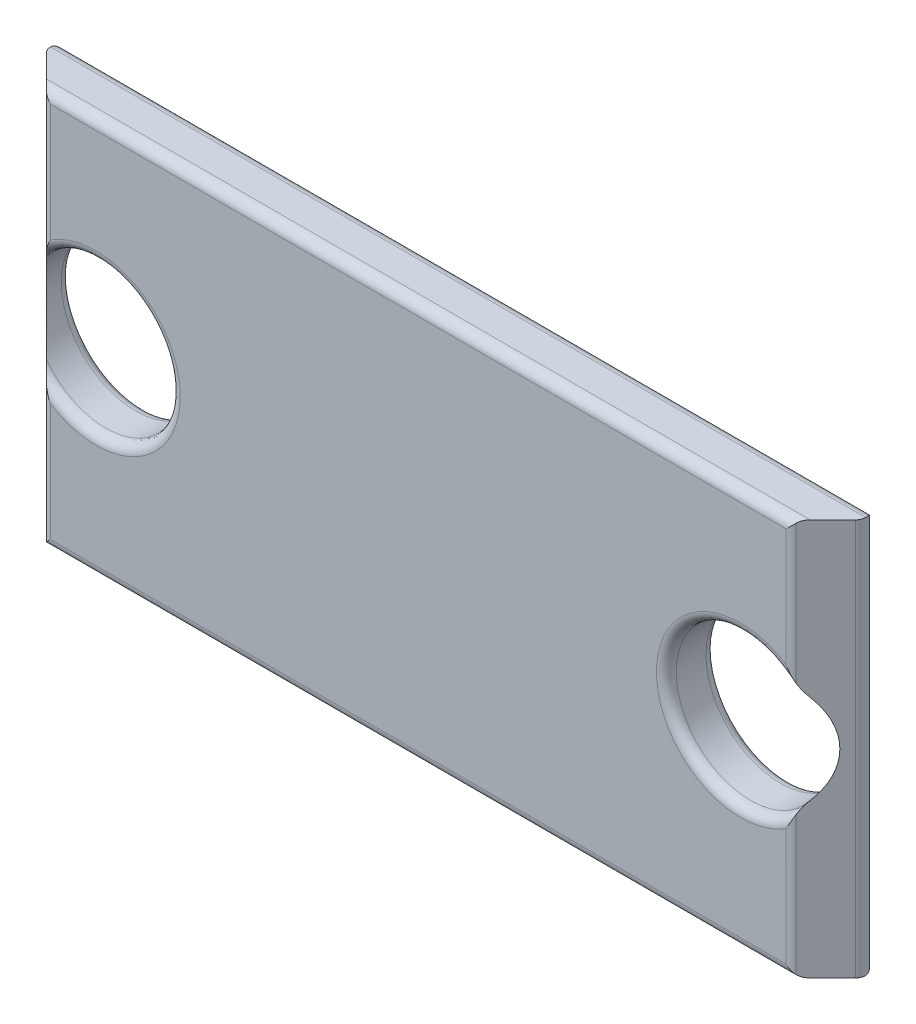
ISO-10303-21;
HEADER;
FILE_DESCRIPTION(('STEP AP214'),'2;1');
FILE_NAME('part.step','',(''),(''),'','','');
FILE_SCHEMA(('AUTOMOTIVE_DESIGN { 1 0 10303 214 1 1 1 1 }'));
ENDSEC;
DATA;
#1=APPLICATION_CONTEXT('core data for automotive mechanical design processes');
#2=APPLICATION_PROTOCOL_DEFINITION('international standard','automotive_design',2000,#1);
#3=PRODUCT_CONTEXT('',#1,'mechanical');
#4=PRODUCT('Part','Part','',(#3));
#5=PRODUCT_RELATED_PRODUCT_CATEGORY('part','',(#4));
#6=PRODUCT_DEFINITION_FORMATION('','',#4);
#7=PRODUCT_DEFINITION_CONTEXT('part definition',#1,'design');
#8=PRODUCT_DEFINITION('design','',#6,#7);
#9=PRODUCT_DEFINITION_SHAPE('','',#8);
#10=(LENGTH_UNIT() NAMED_UNIT(*) SI_UNIT(.MILLI.,.METRE.));
#11=(NAMED_UNIT(*) PLANE_ANGLE_UNIT() SI_UNIT($,.RADIAN.));
#12=(NAMED_UNIT(*) SI_UNIT($,.STERADIAN.) SOLID_ANGLE_UNIT());
#13=UNCERTAINTY_MEASURE_WITH_UNIT(LENGTH_MEASURE(1.E-05),#10,'distance_accuracy_value','');
#14=(GEOMETRIC_REPRESENTATION_CONTEXT(3) GLOBAL_UNCERTAINTY_ASSIGNED_CONTEXT((#13)) GLOBAL_UNIT_ASSIGNED_CONTEXT((#10,
#11,#12)) REPRESENTATION_CONTEXT('',''));
#15=CARTESIAN_POINT('',(0.,0.,0.));
#16=DIRECTION('',(0.,0.,1.));
#17=DIRECTION('',(1.,0.,0.));
#18=AXIS2_PLACEMENT_3D('',#15,#16,#17);
#19=CARTESIAN_POINT('',(0.,0.,1.));
#20=DIRECTION('',(0.,0.,-1.));
#21=DIRECTION('',(-1.,0.,0.));
#22=AXIS2_PLACEMENT_3D('',#19,#20,#21);
#23=PLANE('',#22);
#24=CARTESIAN_POINT('',(2.,4.,1.));
#25=DIRECTION('',(0.,0.,-1.));
#26=DIRECTION('',(-1.,0.,0.));
#27=AXIS2_PLACEMENT_3D('',#24,#25,#26);
#28=CIRCLE('',#27,1.7);
#29=CARTESIAN_POINT('',(1.08284271247464,5.43137084989849,1.));
#30=VERTEX_POINT('',#29);
#31=CARTESIAN_POINT('',(1.08284271247464,2.56862915010151,1.));
#32=VERTEX_POINT('',#31);
#33=EDGE_CURVE('E42',#30,#32,#28,.T.);
#34=ORIENTED_EDGE('',*,*,#33,.T.);
#35=DIRECTION('',(0.,1.,0.));
#36=VECTOR('',#35,1.);
#37=CARTESIAN_POINT('',(1.08284271247464,0.,1.));
#38=LINE('',#37,#36);
#39=CARTESIAN_POINT('',(1.08284271247464,0.2,1.));
#40=VERTEX_POINT('',#39);
#41=EDGE_CURVE('E11',#32,#40,#38,.F.);
#42=ORIENTED_EDGE('',*,*,#41,.T.);
#43=DIRECTION('',(1.,0.,0.));
#44=VECTOR('',#43,1.);
#45=CARTESIAN_POINT('',(0.,0.2,1.));
#46=LINE('',#45,#44);
#47=CARTESIAN_POINT('',(15.9171572875254,0.2,1.));
#48=VERTEX_POINT('',#47);
#49=EDGE_CURVE('E341',#40,#48,#46,.T.);
#50=ORIENTED_EDGE('',*,*,#49,.T.);
#51=DIRECTION('',(0.,-1.,0.));
#52=VECTOR('',#51,1.);
#53=CARTESIAN_POINT('',(15.9171572875254,2.88196601125009,1.));
#54=LINE('',#53,#52);
#55=CARTESIAN_POINT('',(15.9171572875254,2.56862915010151,1.));
#56=VERTEX_POINT('',#55);
#57=EDGE_CURVE('E343',#48,#56,#54,.F.);
#58=ORIENTED_EDGE('',*,*,#57,.T.);
#59=CARTESIAN_POINT('',(15.,4.,1.));
#60=DIRECTION('',(0.,0.,-1.));
#61=DIRECTION('',(-1.,0.,0.));
#62=AXIS2_PLACEMENT_3D('',#59,#60,#61);
#63=CIRCLE('',#62,1.7);
#64=CARTESIAN_POINT('',(15.9171572875254,5.43137084989849,1.));
#65=VERTEX_POINT('',#64);
#66=EDGE_CURVE('E345',#56,#65,#63,.T.);
#67=ORIENTED_EDGE('',*,*,#66,.T.);
#68=DIRECTION('',(0.,-1.,0.));
#69=VECTOR('',#68,1.);
#70=CARTESIAN_POINT('',(15.9171572875254,8.,1.));
#71=LINE('',#70,#69);
#72=CARTESIAN_POINT('',(15.9171572875254,7.8,1.));
#73=VERTEX_POINT('',#72);
#74=EDGE_CURVE('E347',#65,#73,#71,.F.);
#75=ORIENTED_EDGE('',*,*,#74,.T.);
#76=DIRECTION('',(-1.,0.,0.));
#77=VECTOR('',#76,1.);
#78=CARTESIAN_POINT('',(0.,7.8,1.));
#79=LINE('',#78,#77);
#80=CARTESIAN_POINT('',(1.08284271247464,7.8,1.));
#81=VERTEX_POINT('',#80);
#82=EDGE_CURVE('E349',#73,#81,#79,.T.);
#83=ORIENTED_EDGE('',*,*,#82,.T.);
#84=DIRECTION('',(0.,1.,0.));
#85=VECTOR('',#84,1.);
#86=CARTESIAN_POINT('',(1.08284271247464,5.11803398874991,1.));
#87=LINE('',#86,#85);
#88=EDGE_CURVE('E53',#81,#30,#87,.F.);
#89=ORIENTED_EDGE('',*,*,#88,.T.);
#90=EDGE_LOOP('',(#34,#42,#50,#58,#67,#75,#83,#89));
#91=FACE_BOUND('',#90,.T.);
#92=ADVANCED_FACE('F33',(#91),#23,.F.);
#93=CARTESIAN_POINT('',(0.,0.,0.));
#94=DIRECTION('',(0.,0.,-1.));
#95=DIRECTION('',(-1.,0.,0.));
#96=AXIS2_PLACEMENT_3D('',#93,#94,#95);
#97=PLANE('',#96);
#98=CARTESIAN_POINT('',(15.,4.,0.));
#99=DIRECTION('',(0.,0.,-1.));
#100=DIRECTION('',(-1.,0.,0.));
#101=AXIS2_PLACEMENT_3D('',#98,#99,#100);
#102=CIRCLE('',#101,1.7);
#103=CARTESIAN_POINT('',(16.5171572875254,4.76696399192443,0.));
#104=VERTEX_POINT('',#103);
#105=CARTESIAN_POINT('',(16.5171572875254,3.23303600807556,0.));
#106=VERTEX_POINT('',#105);
#107=EDGE_CURVE('E202',#104,#106,#102,.F.);
#108=ORIENTED_EDGE('',*,*,#107,.T.);
#109=DIRECTION('',(0.,-1.,0.));
#110=VECTOR('',#109,1.);
#111=CARTESIAN_POINT('',(16.5171572875254,0.,0.));
#112=LINE('',#111,#110);
#113=CARTESIAN_POINT('',(16.5171572875254,0.2,0.));
#114=VERTEX_POINT('',#113);
#115=EDGE_CURVE('E204',#106,#114,#112,.T.);
#116=ORIENTED_EDGE('',*,*,#115,.T.);
#117=DIRECTION('',(1.,0.,0.));
#118=VECTOR('',#117,1.);
#119=CARTESIAN_POINT('',(0.,0.2,0.));
#120=LINE('',#119,#118);
#121=CARTESIAN_POINT('',(0.48284271247463,0.2,0.));
#122=VERTEX_POINT('',#121);
#123=EDGE_CURVE('E200',#114,#122,#120,.F.);
#124=ORIENTED_EDGE('',*,*,#123,.T.);
#125=DIRECTION('',(0.,1.,0.));
#126=VECTOR('',#125,1.);
#127=CARTESIAN_POINT('',(0.48284271247463,0.,0.));
#128=LINE('',#127,#126);
#129=CARTESIAN_POINT('',(0.48284271247463,3.23303600807557,0.));
#130=VERTEX_POINT('',#129);
#131=EDGE_CURVE('E179',#122,#130,#128,.T.);
#132=ORIENTED_EDGE('',*,*,#131,.T.);
#133=CARTESIAN_POINT('',(2.,4.,0.));
#134=DIRECTION('',(0.,0.,-1.));
#135=DIRECTION('',(-1.,0.,0.));
#136=AXIS2_PLACEMENT_3D('',#133,#134,#135);
#137=CIRCLE('',#136,1.7);
#138=CARTESIAN_POINT('',(3.7,4.,0.));
#139=VERTEX_POINT('',#138);
#140=EDGE_CURVE('E172',#130,#139,#137,.F.);
#141=ORIENTED_EDGE('',*,*,#140,.T.);
#142=CARTESIAN_POINT('',(2.,4.,0.));
#143=DIRECTION('',(0.,0.,-1.));
#144=DIRECTION('',(-1.,0.,0.));
#145=AXIS2_PLACEMENT_3D('',#142,#143,#144);
#146=CIRCLE('',#145,1.7);
#147=CARTESIAN_POINT('',(0.48284271247463,4.76696399192443,0.));
#148=VERTEX_POINT('',#147);
#149=EDGE_CURVE('E176',#139,#148,#146,.F.);
#150=ORIENTED_EDGE('',*,*,#149,.T.);
#151=DIRECTION('',(0.,1.,0.));
#152=VECTOR('',#151,1.);
#153=CARTESIAN_POINT('',(0.48284271247463,0.,0.));
#154=LINE('',#153,#152);
#155=CARTESIAN_POINT('',(0.48284271247463,7.8,0.));
#156=VERTEX_POINT('',#155);
#157=EDGE_CURVE('E182',#148,#156,#154,.T.);
#158=ORIENTED_EDGE('',*,*,#157,.T.);
#159=DIRECTION('',(-1.,0.,0.));
#160=VECTOR('',#159,1.);
#161=CARTESIAN_POINT('',(17.,7.8,0.));
#162=LINE('',#161,#160);
#163=CARTESIAN_POINT('',(16.5171572875254,7.8,0.));
#164=VERTEX_POINT('',#163);
#165=EDGE_CURVE('E196',#156,#164,#162,.F.);
#166=ORIENTED_EDGE('',*,*,#165,.T.);
#167=DIRECTION('',(0.,-1.,0.));
#168=VECTOR('',#167,1.);
#169=CARTESIAN_POINT('',(16.5171572875254,0.,0.));
#170=LINE('',#169,#168);
#171=EDGE_CURVE('E198',#164,#104,#170,.T.);
#172=ORIENTED_EDGE('',*,*,#171,.T.);
#173=EDGE_LOOP('',(#108,#116,#124,#132,#141,#150,#158,#166,#172));
#174=FACE_BOUND('',#173,.T.);
#175=ADVANCED_FACE('F175',(#174),#97,.T.);
#176=CARTESIAN_POINT('',(0.,0.,1.));
#177=DIRECTION('',(0.,1.,0.));
#178=DIRECTION('',(0.,0.,1.));
#179=AXIS2_PLACEMENT_3D('',#176,#177,#178);
#180=PLANE('',#179);
#181=DIRECTION('',(1.,0.,0.));
#182=VECTOR('',#181,1.);
#183=CARTESIAN_POINT('',(17.,0.,0.2));
#184=LINE('',#183,#182);
#185=CARTESIAN_POINT('',(0.28284271247463,0.,0.2));
#186=VERTEX_POINT('',#185);
#187=CARTESIAN_POINT('',(16.7171572875254,0.,0.2));
#188=VERTEX_POINT('',#187);
#189=EDGE_CURVE('E215',#186,#188,#184,.T.);
#190=ORIENTED_EDGE('',*,*,#189,.T.);
#191=CARTESIAN_POINT('',(16.5171572875254,0.,0.2));
#192=DIRECTION('',(0.,1.,0.));
#193=DIRECTION('',(0.,0.,1.));
#194=AXIS2_PLACEMENT_3D('',#191,#192,#193);
#195=CIRCLE('',#194,0.2);
#196=CARTESIAN_POINT('',(16.6585786437627,0.,0.341421356237311));
#197=VERTEX_POINT('',#196);
#198=EDGE_CURVE('E218',#188,#197,#195,.F.);
#199=ORIENTED_EDGE('',*,*,#198,.T.);
#200=DIRECTION('',(0.707106781186551,0.,-0.707106781186544));
#201=VECTOR('',#200,1.);
#202=CARTESIAN_POINT('',(16.,0.,1.));
#203=LINE('',#202,#201);
#204=CARTESIAN_POINT('',(16.2,0.,0.8));
#205=VERTEX_POINT('',#204);
#206=EDGE_CURVE('E190',#197,#205,#203,.F.);
#207=ORIENTED_EDGE('',*,*,#206,.T.);
#208=DIRECTION('',(1.,0.,0.));
#209=VECTOR('',#208,1.);
#210=CARTESIAN_POINT('',(0.,0.,0.8));
#211=LINE('',#210,#209);
#212=CARTESIAN_POINT('',(0.800000000000016,0.,0.8));
#213=VERTEX_POINT('',#212);
#214=EDGE_CURVE('E211',#205,#213,#211,.F.);
#215=ORIENTED_EDGE('',*,*,#214,.T.);
#216=DIRECTION('',(0.707106781186551,0.,0.707106781186544));
#217=VECTOR('',#216,1.);
#218=CARTESIAN_POINT('',(1.00000000000002,0.,1.));
#219=LINE('',#218,#217);
#220=CARTESIAN_POINT('',(0.341421356237321,0.,0.34142135623731));
#221=VERTEX_POINT('',#220);
#222=EDGE_CURVE('E436',#213,#221,#219,.F.);
#223=ORIENTED_EDGE('',*,*,#222,.T.);
#224=CARTESIAN_POINT('',(0.48284271247463,0.,0.2));
#225=DIRECTION('',(0.,1.,0.));
#226=DIRECTION('',(0.,0.,1.));
#227=AXIS2_PLACEMENT_3D('',#224,#225,#226);
#228=CIRCLE('',#227,0.2);
#229=EDGE_CURVE('E213',#221,#186,#228,.F.);
#230=ORIENTED_EDGE('',*,*,#229,.T.);
#231=EDGE_LOOP('',(#190,#199,#207,#215,#223,#230));
#232=FACE_BOUND('',#231,.T.);
#233=ADVANCED_FACE('F435',(#232),#180,.F.);
#234=CARTESIAN_POINT('',(0.,8.,1.));
#235=DIRECTION('',(0.,-1.,0.));
#236=DIRECTION('',(0.,0.,-1.));
#237=AXIS2_PLACEMENT_3D('',#234,#235,#236);
#238=PLANE('',#237);
#239=DIRECTION('',(-0.707106781186551,0.,0.707106781186544));
#240=VECTOR('',#239,1.);
#241=CARTESIAN_POINT('',(16.,8.,1.));
#242=LINE('',#241,#240);
#243=CARTESIAN_POINT('',(16.2,8.,0.8));
#244=VERTEX_POINT('',#243);
#245=CARTESIAN_POINT('',(16.6585786437627,8.,0.341421356237311));
#246=VERTEX_POINT('',#245);
#247=EDGE_CURVE('E439',#244,#246,#242,.F.);
#248=ORIENTED_EDGE('',*,*,#247,.T.);
#249=CARTESIAN_POINT('',(16.5171572875254,8.,0.2));
#250=DIRECTION('',(0.,-1.,0.));
#251=DIRECTION('',(0.,0.,-1.));
#252=AXIS2_PLACEMENT_3D('',#249,#250,#251);
#253=CIRCLE('',#252,0.2);
#254=CARTESIAN_POINT('',(16.7171572875254,8.,0.2));
#255=VERTEX_POINT('',#254);
#256=EDGE_CURVE('E401',#246,#255,#253,.F.);
#257=ORIENTED_EDGE('',*,*,#256,.T.);
#258=DIRECTION('',(-1.,0.,0.));
#259=VECTOR('',#258,1.);
#260=CARTESIAN_POINT('',(0.,8.,0.2));
#261=LINE('',#260,#259);
#262=CARTESIAN_POINT('',(0.28284271247463,8.,0.2));
#263=VERTEX_POINT('',#262);
#264=EDGE_CURVE('E402',#255,#263,#261,.T.);
#265=ORIENTED_EDGE('',*,*,#264,.T.);
#266=CARTESIAN_POINT('',(0.48284271247463,8.,0.2));
#267=DIRECTION('',(0.,-1.,0.));
#268=DIRECTION('',(0.,0.,-1.));
#269=AXIS2_PLACEMENT_3D('',#266,#267,#268);
#270=CIRCLE('',#269,0.2);
#271=CARTESIAN_POINT('',(0.341421356237321,8.,0.34142135623731));
#272=VERTEX_POINT('',#271);
#273=EDGE_CURVE('E406',#263,#272,#270,.F.);
#274=ORIENTED_EDGE('',*,*,#273,.T.);
#275=DIRECTION('',(-0.707106781186551,0.,-0.707106781186544));
#276=VECTOR('',#275,1.);
#277=CARTESIAN_POINT('',(1.00000000000002,8.,1.));
#278=LINE('',#277,#276);
#279=CARTESIAN_POINT('',(0.800000000000015,8.,0.8));
#280=VERTEX_POINT('',#279);
#281=EDGE_CURVE('E425',#272,#280,#278,.F.);
#282=ORIENTED_EDGE('',*,*,#281,.T.);
#283=DIRECTION('',(-1.,0.,0.));
#284=VECTOR('',#283,1.);
#285=CARTESIAN_POINT('',(0.,8.,0.8));
#286=LINE('',#285,#284);
#287=EDGE_CURVE('E408',#280,#244,#286,.F.);
#288=ORIENTED_EDGE('',*,*,#287,.T.);
#289=EDGE_LOOP('',(#248,#257,#265,#274,#282,#288));
#290=FACE_BOUND('',#289,.T.);
#291=ADVANCED_FACE('F447',(#290),#238,.F.);
#292=CARTESIAN_POINT('',(2.,4.,1.));
#293=DIRECTION('',(0.,0.,-1.));
#294=DIRECTION('',(-1.,0.,0.));
#295=AXIS2_PLACEMENT_3D('',#292,#293,#294);
#296=CYLINDRICAL_SURFACE('',#295,1.5);
#297=CARTESIAN_POINT('',(2.,4.,0.2));
#298=DIRECTION('',(0.,0.,-1.));
#299=DIRECTION('',(-1.,0.,0.));
#300=AXIS2_PLACEMENT_3D('',#297,#298,#299);
#301=CIRCLE('',#300,1.5);
#302=CARTESIAN_POINT('',(0.500000000000001,4.,0.2));
#303=VERTEX_POINT('',#302);
#304=EDGE_CURVE('E338',#303,#303,#301,.T.);
#305=ORIENTED_EDGE('',*,*,#304,.T.);
#306=EDGE_LOOP('',(#305));
#307=FACE_BOUND('',#306,.T.);
#308=CARTESIAN_POINT('',(2.,4.,1.99999999999997));
#309=DIRECTION('',(0.707106781186544,0.,-0.707106781186551));
#310=DIRECTION('',(-0.707106781186551,0.,-0.707106781186544));
#311=AXIS2_PLACEMENT_3D('',#308,#309,#310);
#312=ELLIPSE('',#311,2.12132034355963,1.5);
#313=CARTESIAN_POINT('',(0.800000000000016,4.90000000000002,0.8));
#314=VERTEX_POINT('',#313);
#315=CARTESIAN_POINT('',(0.800000000000016,3.09999999999998,0.8));
#316=VERTEX_POINT('',#315);
#317=EDGE_CURVE('E187',#314,#316,#312,.F.);
#318=ORIENTED_EDGE('',*,*,#317,.T.);
#319=CARTESIAN_POINT('',(2.,4.,0.8));
#320=DIRECTION('',(0.,0.,-1.));
#321=DIRECTION('',(-1.,0.,0.));
#322=AXIS2_PLACEMENT_3D('',#319,#320,#321);
#323=CIRCLE('',#322,1.5);
#324=EDGE_CURVE('E336',#316,#314,#323,.F.);
#325=ORIENTED_EDGE('',*,*,#324,.T.);
#326=EDGE_LOOP('',(#318,#325));
#327=FACE_BOUND('',#326,.T.);
#328=ADVANCED_FACE('F459',(#307,#327),#296,.F.);
#329=CARTESIAN_POINT('',(15.,4.,1.));
#330=DIRECTION('',(0.,0.,-1.));
#331=DIRECTION('',(-1.,0.,0.));
#332=AXIS2_PLACEMENT_3D('',#329,#330,#331);
#333=CYLINDRICAL_SURFACE('',#332,1.5);
#334=CARTESIAN_POINT('',(15.,4.,0.2));
#335=DIRECTION('',(0.,0.,-1.));
#336=DIRECTION('',(-1.,0.,0.));
#337=AXIS2_PLACEMENT_3D('',#334,#335,#336);
#338=CIRCLE('',#337,1.5);
#339=CARTESIAN_POINT('',(13.5,4.,0.2));
#340=VERTEX_POINT('',#339);
#341=EDGE_CURVE('E208',#340,#340,#338,.T.);
#342=ORIENTED_EDGE('',*,*,#341,.T.);
#343=EDGE_LOOP('',(#342));
#344=FACE_BOUND('',#343,.T.);
#345=CARTESIAN_POINT('',(15.,4.,1.99999999999997));
#346=DIRECTION('',(-0.707106781186544,0.,-0.707106781186551));
#347=DIRECTION('',(0.707106781186551,0.,-0.707106781186544));
#348=AXIS2_PLACEMENT_3D('',#345,#346,#347);
#349=ELLIPSE('',#348,2.12132034355963,1.5);
#350=CARTESIAN_POINT('',(16.2,3.09999999999998,0.8));
#351=VERTEX_POINT('',#350);
#352=CARTESIAN_POINT('',(16.2,4.90000000000002,0.8));
#353=VERTEX_POINT('',#352);
#354=EDGE_CURVE('E384',#351,#353,#349,.F.);
#355=ORIENTED_EDGE('',*,*,#354,.T.);
#356=CARTESIAN_POINT('',(15.,4.,0.8));
#357=DIRECTION('',(0.,0.,-1.));
#358=DIRECTION('',(-1.,0.,0.));
#359=AXIS2_PLACEMENT_3D('',#356,#357,#358);
#360=CIRCLE('',#359,1.5);
#361=EDGE_CURVE('E206',#353,#351,#360,.F.);
#362=ORIENTED_EDGE('',*,*,#361,.T.);
#363=EDGE_LOOP('',(#355,#362));
#364=FACE_BOUND('',#363,.T.);
#365=ADVANCED_FACE('F424',(#344,#364),#333,.F.);
#366=CARTESIAN_POINT('',(16.,0.,1.));
#367=DIRECTION('',(-0.707106781186544,0.,-0.707106781186551));
#368=DIRECTION('',(0.,1.,0.));
#369=AXIS2_PLACEMENT_3D('',#366,#367,#368);
#370=PLANE('',#369);
#371=ORIENTED_EDGE('',*,*,#206,.F.);
#372=DIRECTION('',(0.,1.,0.));
#373=VECTOR('',#372,1.);
#374=CARTESIAN_POINT('',(16.6585786437627,0.,0.341421356237311));
#375=LINE('',#374,#373);
#376=EDGE_CURVE('E410',#197,#246,#375,.T.);
#377=ORIENTED_EDGE('',*,*,#376,.T.);
#378=ORIENTED_EDGE('',*,*,#247,.F.);
#379=CARTESIAN_POINT('',(16.2,7.8,0.8));
#380=DIRECTION('',(-0.707106781186544,0.,-0.707106781186551));
#381=DIRECTION('',(-0.707106781186551,0.,0.707106781186544));
#382=AXIS2_PLACEMENT_3D('',#379,#380,#381);
#383=ELLIPSE('',#382,0.282842712474621,0.2);
#384=CARTESIAN_POINT('',(16.0585786437627,7.94142135623731,0.941421356237311));
#385=VERTEX_POINT('',#384);
#386=EDGE_CURVE('E412',#244,#385,#383,.F.);
#387=ORIENTED_EDGE('',*,*,#386,.T.);
#388=DIRECTION('',(0.,1.,0.));
#389=VECTOR('',#388,1.);
#390=CARTESIAN_POINT('',(16.0585786437627,5.11803398874991,0.941421356237311));
#391=LINE('',#390,#389);
#392=CARTESIAN_POINT('',(16.0585786437627,5.14393122335337,0.941421356237311));
#393=VERTEX_POINT('',#392);
#394=EDGE_CURVE('E413',#385,#393,#391,.F.);
#395=ORIENTED_EDGE('',*,*,#394,.T.);
#396=CARTESIAN_POINT('',(16.0585786437627,5.14393122335337,0.941421356237311));
#397=CARTESIAN_POINT('',(16.0634928143676,5.13269418980903,0.936507185632398));
#398=CARTESIAN_POINT('',(16.0685700247853,5.12160337478219,0.931429975214728));
#399=CARTESIAN_POINT('',(16.0790090001274,5.09969685376256,0.920990999872591));
#400=CARTESIAN_POINT('',(16.0843706870066,5.08888107350709,0.915629312993347));
#401=CARTESIAN_POINT('',(16.1007827267986,5.05689242498558,0.89921727320142));
#402=CARTESIAN_POINT('',(16.1121979874679,5.03609324485636,0.887802012532107));
#403=CARTESIAN_POINT('',(16.1358317245427,4.99546310719201,0.864168275457283));
#404=CARTESIAN_POINT('',(16.148049453513,4.97563127783374,0.851950546486992));
#405=CARTESIAN_POINT('',(16.1670079191237,4.94664421305119,0.83299208087624));
#406=CARTESIAN_POINT('',(16.1734455248222,4.93709125789246,0.826554475177784));
#407=CARTESIAN_POINT('',(16.1865475500237,4.91829846774346,0.813452449976301));
#408=CARTESIAN_POINT('',(16.1932120130583,4.90905869353609,0.80678798694165));
#409=CARTESIAN_POINT('',(16.1999999999972,4.89999999999758,0.800000000002793));
#410=B_SPLINE_CURVE_WITH_KNOTS('',3,(#396,#397,#398,#399,#400,#401,#402,#403,#404,#405,#406,
#407,#408,#409),.UNSPECIFIED.,.F.,.F.,(4,2,2,2,2,2,4),(0.,0.0396297380023783,0.0792486593697929,
0.158185602148261,0.237050036443959,0.27663258895599,0.316222780257524),.UNSPECIFIED.);
#411=EDGE_CURVE('E231',#393,#353,#410,.T.);
#412=ORIENTED_EDGE('',*,*,#411,.T.);
#413=ORIENTED_EDGE('',*,*,#354,.F.);
#414=CARTESIAN_POINT('',(16.2,3.09999999999998,0.8));
#415=CARTESIAN_POINT('',(16.1932120130597,3.09094130646344,0.806787986940315));
#416=CARTESIAN_POINT('',(16.1865475500244,3.08170153225686,0.813452449975615));
#417=CARTESIAN_POINT('',(16.1734455248223,3.06290874210841,0.826554475177637));
#418=CARTESIAN_POINT('',(16.167007919124,3.05335578694942,0.832992080875985));
#419=CARTESIAN_POINT('',(16.1480494535134,3.02436872216642,0.851950546486592));
#420=CARTESIAN_POINT('',(16.1358317245429,3.00453689280826,0.864168275457045));
#421=CARTESIAN_POINT('',(16.112197987468,2.96390675514394,0.887802012532015));
#422=CARTESIAN_POINT('',(16.1007827267987,2.94310757501465,0.899217273201312));
#423=CARTESIAN_POINT('',(16.0843706870067,2.91111892649306,0.915629312993264));
#424=CARTESIAN_POINT('',(16.0790090001275,2.90030314623756,0.920990999872528));
#425=CARTESIAN_POINT('',(16.0685700247853,2.87839662521787,0.931429975214703));
#426=CARTESIAN_POINT('',(16.0634928143676,2.86730581019101,0.936507185632389));
#427=CARTESIAN_POINT('',(16.0585786437627,2.85606877664663,0.941421356237312));
#428=B_SPLINE_CURVE_WITH_KNOTS('',3,(#414,#415,#416,#417,#418,#419,#420,#421,#422,#423,#424,
#425,#426,#427),.UNSPECIFIED.,.F.,.F.,(4,2,2,2,2,2,4),(0.,0.0395901913018238,0.0791727438140649,
0.158037178110039,0.236974120888608,0.27659304225615,0.31622278025864),.UNSPECIFIED.);
#429=CARTESIAN_POINT('',(16.0585786437627,2.85606877664663,0.941421356237311));
#430=VERTEX_POINT('',#429);
#431=EDGE_CURVE('E224',#351,#430,#428,.T.);
#432=ORIENTED_EDGE('',*,*,#431,.T.);
#433=DIRECTION('',(0.,1.,0.));
#434=VECTOR('',#433,1.);
#435=CARTESIAN_POINT('',(16.0585786437627,0.,0.941421356237311));
#436=LINE('',#435,#434);
#437=CARTESIAN_POINT('',(16.0585786437627,0.0585786437626925,0.941421356237311));
#438=VERTEX_POINT('',#437);
#439=EDGE_CURVE('E222',#430,#438,#436,.F.);
#440=ORIENTED_EDGE('',*,*,#439,.T.);
#441=CARTESIAN_POINT('',(16.2,0.2,0.8));
#442=DIRECTION('',(-0.707106781186544,0.,-0.707106781186551));
#443=DIRECTION('',(0.707106781186551,0.,-0.707106781186544));
#444=AXIS2_PLACEMENT_3D('',#441,#442,#443);
#445=ELLIPSE('',#444,0.282842712474621,0.2);
#446=EDGE_CURVE('E220',#438,#205,#445,.F.);
#447=ORIENTED_EDGE('',*,*,#446,.T.);
#448=EDGE_LOOP('',(#371,#377,#378,#387,#395,#412,#413,#432,#440,#447));
#449=FACE_BOUND('',#448,.T.);
#450=ADVANCED_FACE('F236',(#449),#370,.F.);
#451=CARTESIAN_POINT('',(1.00000000000002,0.,1.));
#452=DIRECTION('',(0.707106781186544,0.,-0.707106781186551));
#453=DIRECTION('',(0.,-1.,0.));
#454=AXIS2_PLACEMENT_3D('',#451,#452,#453);
#455=PLANE('',#454);
#456=ORIENTED_EDGE('',*,*,#281,.F.);
#457=DIRECTION('',(0.,-1.,0.));
#458=VECTOR('',#457,1.);
#459=CARTESIAN_POINT('',(0.341421356237321,0.,0.34142135623731));
#460=LINE('',#459,#458);
#461=EDGE_CURVE('E333',#272,#221,#460,.T.);
#462=ORIENTED_EDGE('',*,*,#461,.T.);
#463=ORIENTED_EDGE('',*,*,#222,.F.);
#464=CARTESIAN_POINT('',(0.800000000000015,0.2,0.8));
#465=DIRECTION('',(0.707106781186544,0.,-0.707106781186551));
#466=DIRECTION('',(0.707106781186551,0.,0.707106781186544));
#467=AXIS2_PLACEMENT_3D('',#464,#465,#466);
#468=ELLIPSE('',#467,0.282842712474621,0.2);
#469=CARTESIAN_POINT('',(0.941421356237327,0.0585786437626913,0.94142135623731));
#470=VERTEX_POINT('',#469);
#471=EDGE_CURVE('E400',#213,#470,#468,.F.);
#472=ORIENTED_EDGE('',*,*,#471,.T.);
#473=DIRECTION('',(0.,-1.,0.));
#474=VECTOR('',#473,1.);
#475=CARTESIAN_POINT('',(0.941421356237327,2.88196601125009,0.94142135623731));
#476=LINE('',#475,#474);
#477=CARTESIAN_POINT('',(0.941421356237327,2.85606877664663,0.94142135623731));
#478=VERTEX_POINT('',#477);
#479=EDGE_CURVE('E317',#470,#478,#476,.F.);
#480=ORIENTED_EDGE('',*,*,#479,.T.);
#481=CARTESIAN_POINT('',(0.941421356237327,2.85606877664663,0.94142135623731));
#482=CARTESIAN_POINT('',(0.936507185632414,2.86730581019097,0.936507185632397));
#483=CARTESIAN_POINT('',(0.931429975214744,2.87839662521781,0.931429975214727));
#484=CARTESIAN_POINT('',(0.920990999872607,2.90030314623744,0.92099099987259));
#485=CARTESIAN_POINT('',(0.915629312993363,2.91111892649291,0.915629312993347));
#486=CARTESIAN_POINT('',(0.899217273201436,2.94310757501442,0.899217273201419));
#487=CARTESIAN_POINT('',(0.887802012532123,2.96390675514364,0.887802012532106));
#488=CARTESIAN_POINT('',(0.864168275457299,3.00453689280799,0.864168275457283));
#489=CARTESIAN_POINT('',(0.851950546487007,3.02436872216625,0.851950546486991));
#490=CARTESIAN_POINT('',(0.832992080876255,3.05335578694881,0.83299208087624));
#491=CARTESIAN_POINT('',(0.8265544751778,3.06290874210754,0.826554475177784));
#492=CARTESIAN_POINT('',(0.813452449976317,3.08170153225654,0.813452449976301));
#493=CARTESIAN_POINT('',(0.806787986941665,3.09094130646391,0.806787986941649));
#494=CARTESIAN_POINT('',(0.800000000002808,3.10000000000242,0.800000000002793));
#495=B_SPLINE_CURVE_WITH_KNOTS('',3,(#481,#482,#483,#484,#485,#486,#487,#488,#489,#490,#491,
#492,#493,#494),.UNSPECIFIED.,.F.,.F.,(4,2,2,2,2,2,4),(0.,0.0396297380023785,0.079248659369792,
0.15818560214826,0.237050036443957,0.276632588955986,0.316222780257521),.UNSPECIFIED.);
#496=EDGE_CURVE('E310',#478,#316,#495,.T.);
#497=ORIENTED_EDGE('',*,*,#496,.T.);
#498=ORIENTED_EDGE('',*,*,#317,.F.);
#499=CARTESIAN_POINT('',(0.800000000000016,4.90000000000002,0.8));
#500=CARTESIAN_POINT('',(0.806787986940331,4.90905869353656,0.806787986940315));
#501=CARTESIAN_POINT('',(0.813452449975631,4.91829846774313,0.813452449975615));
#502=CARTESIAN_POINT('',(0.826554475177653,4.93709125789159,0.826554475177638));
#503=CARTESIAN_POINT('',(0.832992080876001,4.94664421305058,0.832992080875985));
#504=CARTESIAN_POINT('',(0.851950546486607,4.97563127783357,0.851950546486591));
#505=CARTESIAN_POINT('',(0.864168275457061,4.99546310719173,0.864168275457045));
#506=CARTESIAN_POINT('',(0.88780201253203,5.03609324485606,0.887802012532014));
#507=CARTESIAN_POINT('',(0.899217273201328,5.05689242498534,0.899217273201311));
#508=CARTESIAN_POINT('',(0.915629312993279,5.08888107350694,0.915629312993263));
#509=CARTESIAN_POINT('',(0.920990999872544,5.09969685376243,0.920990999872527));
#510=CARTESIAN_POINT('',(0.931429975214718,5.12160337478212,0.931429975214701));
#511=CARTESIAN_POINT('',(0.936507185632404,5.13269418980899,0.936507185632387));
#512=CARTESIAN_POINT('',(0.941421356237327,5.14393122335336,0.94142135623731));
#513=B_SPLINE_CURVE_WITH_KNOTS('',3,(#499,#500,#501,#502,#503,#504,#505,#506,#507,#508,#509,
#510,#511,#512),.UNSPECIFIED.,.F.,.F.,(4,2,2,2,2,2,4),(0.,0.039590191301824,0.079172743814064,
0.158037178110037,0.236974120888605,0.276593042256148,0.316222780258635),.UNSPECIFIED.);
#514=CARTESIAN_POINT('',(0.941421356237327,5.14393122335336,0.94142135623731));
#515=VERTEX_POINT('',#514);
#516=EDGE_CURVE('E328',#314,#515,#513,.T.);
#517=ORIENTED_EDGE('',*,*,#516,.T.);
#518=DIRECTION('',(0.,-1.,0.));
#519=VECTOR('',#518,1.);
#520=CARTESIAN_POINT('',(0.941421356237327,8.,0.94142135623731));
#521=LINE('',#520,#519);
#522=CARTESIAN_POINT('',(0.941421356237327,7.94142135623731,0.94142135623731));
#523=VERTEX_POINT('',#522);
#524=EDGE_CURVE('E334',#515,#523,#521,.F.);
#525=ORIENTED_EDGE('',*,*,#524,.T.);
#526=CARTESIAN_POINT('',(0.800000000000015,7.8,0.8));
#527=DIRECTION('',(0.707106781186544,0.,-0.707106781186551));
#528=DIRECTION('',(-0.707106781186551,0.,-0.707106781186544));
#529=AXIS2_PLACEMENT_3D('',#526,#527,#528);
#530=ELLIPSE('',#529,0.282842712474621,0.2);
#531=EDGE_CURVE('E316',#523,#280,#530,.F.);
#532=ORIENTED_EDGE('',*,*,#531,.T.);
#533=EDGE_LOOP('',(#456,#462,#463,#472,#480,#497,#498,#517,#525,#532));
#534=FACE_BOUND('',#533,.T.);
#535=ADVANCED_FACE('F320',(#534),#455,.F.);
#536=CARTESIAN_POINT('',(2.,4.,0.2));
#537=DIRECTION('',(0.,0.,-1.));
#538=DIRECTION('',(-1.,0.,0.));
#539=AXIS2_PLACEMENT_3D('',#536,#537,#538);
#540=TOROIDAL_SURFACE('',#539,1.7,0.2);
#541=ORIENTED_EDGE('',*,*,#304,.F.);
#542=EDGE_LOOP('',(#541));
#543=FACE_BOUND('',#542,.T.);
#544=ORIENTED_EDGE('',*,*,#149,.F.);
#545=ORIENTED_EDGE('',*,*,#140,.F.);
#546=CARTESIAN_POINT('',(0.48284271247463,4.76696399192443,0.));
#547=CARTESIAN_POINT('',(0.482517205725488,4.76559860739645,1.36432082662236E-08));
#548=CARTESIAN_POINT('',(0.482192521330588,4.76423301860608,8.07699616377272E-07));
#549=CARTESIAN_POINT('',(0.466455114084835,4.69786500615766,7.68191183067233E-05));
#550=CARTESIAN_POINT('',(0.452906411837311,4.63240355106141,0.00189581847383113));
#551=CARTESIAN_POINT('',(0.435525079739619,4.53372557082078,0.00558917983934312));
#552=CARTESIAN_POINT('',(0.430219113165098,4.50073046300288,0.00698232363874068));
#553=CARTESIAN_POINT('',(0.420604869046538,4.43459073809515,0.00986385736370204));
#554=CARTESIAN_POINT('',(0.416296765283045,4.40144609598663,0.0113522638219998));
#555=CARTESIAN_POINT('',(0.407099828840381,4.32109596652642,0.0148069662184307));
#556=CARTESIAN_POINT('',(0.402726221856145,4.27382793111963,0.016711628685514));
#557=CARTESIAN_POINT('',(0.396058986628023,4.17911585749369,0.0197717714361438));
#558=CARTESIAN_POINT('',(0.393765505811261,4.13167180703886,0.0209271986166401));
#559=CARTESIAN_POINT('',(0.391279913336488,4.03669034914553,0.0221845998108757));
#560=CARTESIAN_POINT('',(0.391088811769579,3.9891529078062,0.0222860674469452));
#561=CARTESIAN_POINT('',(0.392812534665278,3.89412876529093,0.0214071142012988));
#562=CARTESIAN_POINT('',(0.394727293044099,3.84664206256958,0.0204267272691531));
#563=CARTESIAN_POINT('',(0.400640947005006,3.75187771216736,0.0176450243503874));
#564=CARTESIAN_POINT('',(0.404637554520436,3.70459989232596,0.0158446098914556));
#565=CARTESIAN_POINT('',(0.414682088454605,3.61026647425869,0.0118959937494696));
#566=CARTESIAN_POINT('',(0.420730536999109,3.56321093568935,0.0097477036163443));
#567=CARTESIAN_POINT('',(0.434829114776114,3.46943839038484,0.00571060266013843));
#568=CARTESIAN_POINT('',(0.442877248977639,3.42272109371651,0.00382153611524466));
#569=CARTESIAN_POINT('',(0.460926963962796,3.32963765205036,0.000994056759156393));
#570=CARTESIAN_POINT('',(0.470928077195246,3.28327142575925,5.54167439738812E-05));
#571=CARTESIAN_POINT('',(0.482192521388957,3.23576698473291,8.01736364853331E-07));
#572=CARTESIAN_POINT('',(0.482517205809296,3.23440139594897,7.5327140923431E-09));
#573=CARTESIAN_POINT('',(0.48284271247463,3.23303600807557,0.));
#574=B_SPLINE_CURVE_WITH_KNOTS('',3,(#546,#547,#548,#549,#550,#551,#552,#553,#554,#555,#556,
#557,#558,#559,#560,#561,#562,#563,#564,#565,#566,#567,#568,#569,#570,#571,#572,#573),
.UNSPECIFIED.,.F.,.F.,(4,2,2,2,2,2,2,2,2,2,2,2,2,4),(0.,0.00421096968112383,0.204623971751215,
0.304960247565119,0.405313984100639,0.547789270593381,0.69027465410867,0.832828491941254,
0.975377856433309,1.11777088086604,1.26020016683398,1.402487921641,1.54474165384641,
1.54895262353978),.UNSPECIFIED.);
#575=EDGE_CURVE('E185',#148,#130,#574,.T.);
#576=ORIENTED_EDGE('',*,*,#575,.F.);
#577=EDGE_LOOP('',(#544,#545,#576));
#578=FACE_BOUND('',#577,.T.);
#579=ADVANCED_FACE('F184',(#543,#578),#540,.T.);
#580=CARTESIAN_POINT('',(0.48284271247463,0.,0.2));
#581=DIRECTION('',(0.,1.,0.));
#582=DIRECTION('',(0.,0.,1.));
#583=AXIS2_PLACEMENT_3D('',#580,#581,#582);
#584=CYLINDRICAL_SURFACE('',#583,0.2);
#585=ORIENTED_EDGE('',*,*,#575,.T.);
#586=ORIENTED_EDGE('',*,*,#131,.F.);
#587=CARTESIAN_POINT('',(0.48284271247463,0.2,0.2));
#588=DIRECTION('',(-0.707106781186547,0.707106781186547,0.));
#589=DIRECTION('',(0.707106781186547,0.707106781186547,0.));
#590=AXIS2_PLACEMENT_3D('',#587,#588,#589);
#591=ELLIPSE('',#590,0.282842712474619,0.2);
#592=EDGE_CURVE('E385',#186,#122,#591,.F.);
#593=ORIENTED_EDGE('',*,*,#592,.F.);
#594=ORIENTED_EDGE('',*,*,#229,.F.);
#595=ORIENTED_EDGE('',*,*,#461,.F.);
#596=ORIENTED_EDGE('',*,*,#273,.F.);
#597=CARTESIAN_POINT('',(0.48284271247463,7.8,0.2));
#598=DIRECTION('',(0.707106781186547,0.707106781186547,0.));
#599=DIRECTION('',(-0.707106781186547,0.707106781186547,0.));
#600=AXIS2_PLACEMENT_3D('',#597,#598,#599);
#601=ELLIPSE('',#600,0.282842712474619,0.2);
#602=EDGE_CURVE('E610',#156,#263,#601,.T.);
#603=ORIENTED_EDGE('',*,*,#602,.F.);
#604=ORIENTED_EDGE('',*,*,#157,.F.);
#605=EDGE_LOOP('',(#585,#586,#593,#594,#595,#596,#603,#604));
#606=FACE_BOUND('',#605,.T.);
#607=ADVANCED_FACE('F297',(#606),#584,.T.);
#608=CARTESIAN_POINT('',(0.,0.2,0.2));
#609=DIRECTION('',(-1.,0.,0.));
#610=DIRECTION('',(0.,0.,1.));
#611=AXIS2_PLACEMENT_3D('',#608,#609,#610);
#612=CYLINDRICAL_SURFACE('',#611,0.2);
#613=ORIENTED_EDGE('',*,*,#592,.T.);
#614=ORIENTED_EDGE('',*,*,#123,.F.);
#615=CARTESIAN_POINT('',(16.5171572875254,0.2,0.2));
#616=DIRECTION('',(-0.707106781186547,-0.707106781186547,0.));
#617=DIRECTION('',(0.707106781186547,-0.707106781186547,0.));
#618=AXIS2_PLACEMENT_3D('',#615,#616,#617);
#619=ELLIPSE('',#618,0.282842712474619,0.2);
#620=EDGE_CURVE('E618',#188,#114,#619,.F.);
#621=ORIENTED_EDGE('',*,*,#620,.F.);
#622=ORIENTED_EDGE('',*,*,#189,.F.);
#623=EDGE_LOOP('',(#613,#614,#621,#622));
#624=FACE_BOUND('',#623,.T.);
#625=ADVANCED_FACE('F372',(#624),#612,.T.);
#626=CARTESIAN_POINT('',(0.,7.8,0.2));
#627=DIRECTION('',(1.,0.,0.));
#628=DIRECTION('',(0.,0.,-1.));
#629=AXIS2_PLACEMENT_3D('',#626,#627,#628);
#630=CYLINDRICAL_SURFACE('',#629,0.2);
#631=ORIENTED_EDGE('',*,*,#602,.T.);
#632=ORIENTED_EDGE('',*,*,#264,.F.);
#633=CARTESIAN_POINT('',(16.5171572875254,7.8,0.2));
#634=DIRECTION('',(0.707106781186547,-0.707106781186547,0.));
#635=DIRECTION('',(0.707106781186547,0.707106781186547,0.));
#636=AXIS2_PLACEMENT_3D('',#633,#634,#635);
#637=ELLIPSE('',#636,0.282842712474619,0.2);
#638=EDGE_CURVE('E358',#164,#255,#637,.T.);
#639=ORIENTED_EDGE('',*,*,#638,.F.);
#640=ORIENTED_EDGE('',*,*,#165,.F.);
#641=EDGE_LOOP('',(#631,#632,#639,#640));
#642=FACE_BOUND('',#641,.T.);
#643=ADVANCED_FACE('F365',(#642),#630,.T.);
#644=CARTESIAN_POINT('',(16.5171572875254,0.,0.2));
#645=DIRECTION('',(0.,-1.,0.));
#646=DIRECTION('',(0.,0.,-1.));
#647=AXIS2_PLACEMENT_3D('',#644,#645,#646);
#648=CYLINDRICAL_SURFACE('',#647,0.2);
#649=CARTESIAN_POINT('',(16.5171572875254,4.76696399192443,0.));
#650=CARTESIAN_POINT('',(16.5174827942745,4.76559860739645,1.36432082572768E-08));
#651=CARTESIAN_POINT('',(16.5178074786694,4.76423301860608,8.07699616368135E-07));
#652=CARTESIAN_POINT('',(16.5335448859152,4.69786500615766,7.68191183067055E-05));
#653=CARTESIAN_POINT('',(16.5470935881627,4.63240355106141,0.00189581847383113));
#654=CARTESIAN_POINT('',(16.5644749202604,4.53372557082078,0.00558917983934316));
#655=CARTESIAN_POINT('',(16.5697808868349,4.50073046300288,0.00698232363874073));
#656=CARTESIAN_POINT('',(16.5793951309535,4.43459073809516,0.00986385736370211));
#657=CARTESIAN_POINT('',(16.583703234717,4.40144609598664,0.0113522638219999));
#658=CARTESIAN_POINT('',(16.5929001711596,4.32109596652642,0.0148069662184309));
#659=CARTESIAN_POINT('',(16.5972737781439,4.27382793111963,0.0167116286855144));
#660=CARTESIAN_POINT('',(16.603941013372,4.17911585749369,0.0197717714361444));
#661=CARTESIAN_POINT('',(16.6062344941887,4.13167180703886,0.0209271986166407));
#662=CARTESIAN_POINT('',(16.6087200866635,4.03669034914553,0.0221845998108763));
#663=CARTESIAN_POINT('',(16.6089111882304,3.9891529078062,0.0222860674469458));
#664=CARTESIAN_POINT('',(16.6071874653347,3.89412876529093,0.0214071142012994));
#665=CARTESIAN_POINT('',(16.6052727069559,3.84664206256958,0.0204267272691536));
#666=CARTESIAN_POINT('',(16.599359052995,3.75187771216735,0.0176450243503877));
#667=CARTESIAN_POINT('',(16.5953624454796,3.70459989232595,0.0158446098914558));
#668=CARTESIAN_POINT('',(16.5853179115454,3.61026647425868,0.0118959937494697));
#669=CARTESIAN_POINT('',(16.5792694630009,3.56321093568934,0.00974770361634444));
#670=CARTESIAN_POINT('',(16.5651708852239,3.46943839038484,0.00571060266013852));
#671=CARTESIAN_POINT('',(16.5571227510224,3.42272109371651,0.0038215361152447));
#672=CARTESIAN_POINT('',(16.5390730360372,3.32963765205035,0.000994056759156491));
#673=CARTESIAN_POINT('',(16.5290719228048,3.28327142575924,5.54167439740967E-05));
#674=CARTESIAN_POINT('',(16.517807478611,3.23576698473291,8.01736364858538E-07));
#675=CARTESIAN_POINT('',(16.5174827941907,3.23440139594896,7.53271409123587E-09));
#676=CARTESIAN_POINT('',(16.5171572875254,3.23303600807556,0.));
#677=B_SPLINE_CURVE_WITH_KNOTS('',3,(#649,#650,#651,#652,#653,#654,#655,#656,#657,#658,#659,
#660,#661,#662,#663,#664,#665,#666,#667,#668,#669,#670,#671,#672,#673,#674,#675,#676),
.UNSPECIFIED.,.F.,.F.,(4,2,2,2,2,2,2,2,2,2,2,2,2,4),(0.,0.00421096968112363,0.204623971751214,
0.304960247565118,0.40531398410064,0.547789270593385,0.690274654108674,0.832828491941262,
0.975377856433319,1.11777088086605,1.26020016683399,1.40248792164101,1.54474165384642,
1.54895262353979),.UNSPECIFIED.);
#678=EDGE_CURVE('E353',#104,#106,#677,.T.);
#679=ORIENTED_EDGE('',*,*,#678,.F.);
#680=ORIENTED_EDGE('',*,*,#171,.F.);
#681=ORIENTED_EDGE('',*,*,#638,.T.);
#682=ORIENTED_EDGE('',*,*,#256,.F.);
#683=ORIENTED_EDGE('',*,*,#376,.F.);
#684=ORIENTED_EDGE('',*,*,#198,.F.);
#685=ORIENTED_EDGE('',*,*,#620,.T.);
#686=ORIENTED_EDGE('',*,*,#115,.F.);
#687=EDGE_LOOP('',(#679,#680,#681,#682,#683,#684,#685,#686));
#688=FACE_BOUND('',#687,.T.);
#689=ADVANCED_FACE('F360',(#688),#648,.T.);
#690=CARTESIAN_POINT('',(15.,4.,0.2));
#691=DIRECTION('',(0.,0.,-1.));
#692=DIRECTION('',(-1.,0.,0.));
#693=AXIS2_PLACEMENT_3D('',#690,#691,#692);
#694=TOROIDAL_SURFACE('',#693,1.7,0.2);
#695=ORIENTED_EDGE('',*,*,#341,.F.);
#696=EDGE_LOOP('',(#695));
#697=FACE_BOUND('',#696,.T.);
#698=ORIENTED_EDGE('',*,*,#107,.F.);
#699=ORIENTED_EDGE('',*,*,#678,.T.);
#700=EDGE_LOOP('',(#698,#699));
#701=FACE_BOUND('',#700,.T.);
#702=ADVANCED_FACE('F364',(#697,#701),#694,.T.);
#703=CARTESIAN_POINT('',(15.9171572875254,0.,0.8));
#704=DIRECTION('',(0.,1.,0.));
#705=DIRECTION('',(0.,0.,1.));
#706=AXIS2_PLACEMENT_3D('',#703,#704,#705);
#707=CYLINDRICAL_SURFACE('',#706,0.2);
#708=CARTESIAN_POINT('',(16.0585786437627,5.14393122335337,0.941421356237311));
#709=CARTESIAN_POINT('',(16.0501170279351,5.16329829125546,0.949826220487473));
#710=CARTESIAN_POINT('',(16.0413138349449,5.18293938013167,0.957178476416599));
#711=CARTESIAN_POINT('',(16.0231087292309,5.22254910267645,0.970006960827361));
#712=CARTESIAN_POINT('',(16.0137070364603,5.24251761403446,0.975483873845599));
#713=CARTESIAN_POINT('',(15.9944248816597,5.28248946048168,0.984776511974495));
#714=CARTESIAN_POINT('',(15.9845466679279,5.3024922707837,0.988599324334531));
#715=CARTESIAN_POINT('',(15.9643281895287,5.34250318391945,0.99464464857022));
#716=CARTESIAN_POINT('',(15.9539880156276,5.36251128495235,0.996867473356647));
#717=CARTESIAN_POINT('',(15.9352905546635,5.39790764838586,0.999345668589198));
#718=CARTESIAN_POINT('',(15.9270147136108,5.41331568620541,0.999932665550107));
#719=CARTESIAN_POINT('',(15.9181429787435,5.42956773457905,0.999998173893098));
#720=CARTESIAN_POINT('',(15.9176503101155,5.43046939496248,0.999999996443309));
#721=CARTESIAN_POINT('',(15.9171572875254,5.43137084989849,1.00000000000122));
#722=B_SPLINE_CURVE_WITH_KNOTS('',3,(#708,#709,#710,#711,#712,#713,#714,#715,#716,#717,#718,
#719,#720,#721),.UNSPECIFIED.,.F.,.F.,(4,2,2,2,2,2,4),(0.,0.0681640930061486,0.136303278203168,
0.20414754774407,0.271978545322377,0.324443419307224,0.327525855433389),.UNSPECIFIED.);
#723=EDGE_CURVE('E261',#393,#65,#722,.T.);
#724=ORIENTED_EDGE('',*,*,#723,.F.);
#725=ORIENTED_EDGE('',*,*,#394,.F.);
#726=CARTESIAN_POINT('',(15.9171572875254,7.8,0.8));
#727=DIRECTION('',(-0.707106781186547,0.707106781186547,0.));
#728=DIRECTION('',(0.707106781186547,0.707106781186547,0.));
#729=AXIS2_PLACEMENT_3D('',#726,#727,#728);
#730=ELLIPSE('',#729,0.282842712474619,0.2);
#731=EDGE_CURVE('E37',#73,#385,#730,.T.);
#732=ORIENTED_EDGE('',*,*,#731,.F.);
#733=ORIENTED_EDGE('',*,*,#74,.F.);
#734=EDGE_LOOP('',(#724,#725,#732,#733));
#735=FACE_BOUND('',#734,.T.);
#736=ADVANCED_FACE('F249',(#735),#707,.T.);
#737=CARTESIAN_POINT('',(0.,7.8,0.8));
#738=DIRECTION('',(-1.,0.,0.));
#739=DIRECTION('',(0.,0.,1.));
#740=AXIS2_PLACEMENT_3D('',#737,#738,#739);
#741=CYLINDRICAL_SURFACE('',#740,0.2);
#742=ORIENTED_EDGE('',*,*,#287,.F.);
#743=ORIENTED_EDGE('',*,*,#531,.F.);
#744=CARTESIAN_POINT('',(1.08284271247464,7.8,0.8));
#745=DIRECTION('',(-0.707106781186547,-0.707106781186547,0.));
#746=DIRECTION('',(-0.707106781186547,0.707106781186547,0.));
#747=AXIS2_PLACEMENT_3D('',#744,#745,#746);
#748=ELLIPSE('',#747,0.282842712474619,0.2);
#749=EDGE_CURVE('E266',#81,#523,#748,.T.);
#750=ORIENTED_EDGE('',*,*,#749,.F.);
#751=ORIENTED_EDGE('',*,*,#82,.F.);
#752=ORIENTED_EDGE('',*,*,#731,.T.);
#753=ORIENTED_EDGE('',*,*,#386,.F.);
#754=EDGE_LOOP('',(#742,#743,#750,#751,#752,#753));
#755=FACE_BOUND('',#754,.T.);
#756=ADVANCED_FACE('F35',(#755),#741,.T.);
#757=CARTESIAN_POINT('',(15.,4.,0.8));
#758=DIRECTION('',(0.,0.,-1.));
#759=DIRECTION('',(-1.,0.,0.));
#760=AXIS2_PLACEMENT_3D('',#757,#758,#759);
#761=TOROIDAL_SURFACE('',#760,1.7,0.2);
#762=ORIENTED_EDGE('',*,*,#723,.T.);
#763=ORIENTED_EDGE('',*,*,#66,.F.);
#764=CARTESIAN_POINT('',(16.0585786437627,2.85606877664663,0.941421356237311));
#765=CARTESIAN_POINT('',(16.0501170279351,2.83670170874454,0.949826220487473));
#766=CARTESIAN_POINT('',(16.0413138349449,2.81706061986832,0.957178476416599));
#767=CARTESIAN_POINT('',(16.0231087292309,2.77745089732355,0.970006960827361));
#768=CARTESIAN_POINT('',(16.0137070364603,2.75748238596554,0.975483873845599));
#769=CARTESIAN_POINT('',(15.9944248816597,2.71751053951832,0.984776511974495));
#770=CARTESIAN_POINT('',(15.9845466679279,2.69750772921629,0.988599324334531));
#771=CARTESIAN_POINT('',(15.9643281895287,2.65749681608054,0.99464464857022));
#772=CARTESIAN_POINT('',(15.9539880156276,2.63748871504764,0.996867473356647));
#773=CARTESIAN_POINT('',(15.9352905546635,2.60209235161414,0.999345668589198));
#774=CARTESIAN_POINT('',(15.9270147136108,2.58668431379459,0.999932665550107));
#775=CARTESIAN_POINT('',(15.9181429787435,2.57043226542095,0.999998173893098));
#776=CARTESIAN_POINT('',(15.9176503101155,2.56953060503751,0.999999996443309));
#777=CARTESIAN_POINT('',(15.9171572875254,2.56862915010151,1.00000000000122));
#778=B_SPLINE_CURVE_WITH_KNOTS('',3,(#764,#765,#766,#767,#768,#769,#770,#771,#772,#773,#774,
#775,#776,#777),.UNSPECIFIED.,.F.,.F.,(4,2,2,2,2,2,4),(0.,0.0681640930061481,0.13630327820317,
0.204147547744071,0.271978545322378,0.324443419307223,0.327525855433389),.UNSPECIFIED.);
#779=EDGE_CURVE('E254',#430,#56,#778,.T.);
#780=ORIENTED_EDGE('',*,*,#779,.F.);
#781=ORIENTED_EDGE('',*,*,#431,.F.);
#782=ORIENTED_EDGE('',*,*,#361,.F.);
#783=ORIENTED_EDGE('',*,*,#411,.F.);
#784=EDGE_LOOP('',(#762,#763,#780,#781,#782,#783));
#785=FACE_BOUND('',#784,.T.);
#786=ADVANCED_FACE('F240',(#785),#761,.T.);
#787=CARTESIAN_POINT('',(1.08284271247464,0.,0.8));
#788=DIRECTION('',(0.,-1.,0.));
#789=DIRECTION('',(0.,0.,-1.));
#790=AXIS2_PLACEMENT_3D('',#787,#788,#789);
#791=CYLINDRICAL_SURFACE('',#790,0.2);
#792=ORIENTED_EDGE('',*,*,#749,.T.);
#793=ORIENTED_EDGE('',*,*,#524,.F.);
#794=CARTESIAN_POINT('',(0.941421356237327,5.14393122335336,0.94142135623731));
#795=CARTESIAN_POINT('',(0.949882972064912,5.16329829125546,0.949826220487472));
#796=CARTESIAN_POINT('',(0.958686165055061,5.18293938013167,0.957178476416598));
#797=CARTESIAN_POINT('',(0.97689127076914,5.22254910267644,0.97000696082736));
#798=CARTESIAN_POINT('',(0.986292963539734,5.24251761403445,0.975483873845598));
#799=CARTESIAN_POINT('',(1.00557511834025,5.28248946048168,0.984776511974494));
#800=CARTESIAN_POINT('',(1.01545333207208,5.3024922707837,0.988599324334531));
#801=CARTESIAN_POINT('',(1.03567181047129,5.34250318391945,0.99464464857022));
#802=CARTESIAN_POINT('',(1.04601198437243,5.36251128495235,0.996867473356647));
#803=CARTESIAN_POINT('',(1.06470944533652,5.39790764838586,0.999345668589198));
#804=CARTESIAN_POINT('',(1.0729852863892,5.41331568620541,0.999932665550107));
#805=CARTESIAN_POINT('',(1.08185702125646,5.42956773457904,0.999998173893098));
#806=CARTESIAN_POINT('',(1.08234968988455,5.43046939496248,0.999999996443309));
#807=CARTESIAN_POINT('',(1.08284271247464,5.43137084989849,1.00000000000122));
#808=B_SPLINE_CURVE_WITH_KNOTS('',3,(#794,#795,#796,#797,#798,#799,#800,#801,#802,#803,#804,
#805,#806,#807),.UNSPECIFIED.,.F.,.F.,(4,2,2,2,2,2,4),(0.,0.068164093006147,0.136303278203167,
0.204147547744071,0.271978545322378,0.324443419307224,0.327525855433391),.UNSPECIFIED.);
#809=EDGE_CURVE('E272',#30,#515,#808,.F.);
#810=ORIENTED_EDGE('',*,*,#809,.F.);
#811=ORIENTED_EDGE('',*,*,#88,.F.);
#812=EDGE_LOOP('',(#792,#793,#810,#811));
#813=FACE_BOUND('',#812,.T.);
#814=ADVANCED_FACE('F244',(#813),#791,.T.);
#815=CARTESIAN_POINT('',(15.9171572875254,0.,0.8));
#816=DIRECTION('',(0.,1.,0.));
#817=DIRECTION('',(0.,0.,1.));
#818=AXIS2_PLACEMENT_3D('',#815,#816,#817);
#819=CYLINDRICAL_SURFACE('',#818,0.2);
#820=ORIENTED_EDGE('',*,*,#779,.T.);
#821=ORIENTED_EDGE('',*,*,#57,.F.);
#822=CARTESIAN_POINT('',(15.9171572875254,0.2,0.8));
#823=DIRECTION('',(0.707106781186547,0.707106781186547,0.));
#824=DIRECTION('',(0.707106781186547,-0.707106781186547,0.));
#825=AXIS2_PLACEMENT_3D('',#822,#823,#824);
#826=ELLIPSE('',#825,0.282842712474619,0.2);
#827=EDGE_CURVE('E278',#438,#48,#826,.F.);
#828=ORIENTED_EDGE('',*,*,#827,.F.);
#829=ORIENTED_EDGE('',*,*,#439,.F.);
#830=EDGE_LOOP('',(#820,#821,#828,#829));
#831=FACE_BOUND('',#830,.T.);
#832=ADVANCED_FACE('F246',(#831),#819,.T.);
#833=CARTESIAN_POINT('',(2.,4.,0.8));
#834=DIRECTION('',(0.,0.,-1.));
#835=DIRECTION('',(-1.,0.,0.));
#836=AXIS2_PLACEMENT_3D('',#833,#834,#835);
#837=TOROIDAL_SURFACE('',#836,1.7,0.2);
#838=ORIENTED_EDGE('',*,*,#324,.F.);
#839=ORIENTED_EDGE('',*,*,#496,.F.);
#840=CARTESIAN_POINT('',(0.941421356237327,2.85606877664663,0.94142135623731));
#841=CARTESIAN_POINT('',(0.949882972064911,2.83670170874454,0.949826220487472));
#842=CARTESIAN_POINT('',(0.95868616505506,2.81706061986833,0.957178476416597));
#843=CARTESIAN_POINT('',(0.976891270769138,2.77745089732356,0.970006960827359));
#844=CARTESIAN_POINT('',(0.986292963539732,2.75748238596555,0.975483873845597));
#845=CARTESIAN_POINT('',(1.00557511834025,2.71751053951833,0.984776511974493));
#846=CARTESIAN_POINT('',(1.01545333207208,2.6975077292163,0.98859932433453));
#847=CARTESIAN_POINT('',(1.03567181047129,2.65749681608055,0.994644648570219));
#848=CARTESIAN_POINT('',(1.04601198437243,2.63748871504765,0.996867473356647));
#849=CARTESIAN_POINT('',(1.06470944533652,2.60209235161414,0.999345668589198));
#850=CARTESIAN_POINT('',(1.07298528638919,2.58668431379458,0.999932665550107));
#851=CARTESIAN_POINT('',(1.08185702125646,2.57043226542095,0.999998173893098));
#852=CARTESIAN_POINT('',(1.08234968988454,2.56953060503751,0.999999996443309));
#853=CARTESIAN_POINT('',(1.08284271247464,2.56862915010151,1.00000000000122));
#854=B_SPLINE_CURVE_WITH_KNOTS('',3,(#840,#841,#842,#843,#844,#845,#846,#847,#848,#849,#850,
#851,#852,#853),.UNSPECIFIED.,.F.,.F.,(4,2,2,2,2,2,4),(0.,0.0681640930061435,0.136303278203159,
0.204147547744066,0.271978545322376,0.324443419307223,0.327525855433391),.UNSPECIFIED.);
#855=EDGE_CURVE('E282',#32,#478,#854,.F.);
#856=ORIENTED_EDGE('',*,*,#855,.F.);
#857=ORIENTED_EDGE('',*,*,#33,.F.);
#858=ORIENTED_EDGE('',*,*,#809,.T.);
#859=ORIENTED_EDGE('',*,*,#516,.F.);
#860=EDGE_LOOP('',(#838,#839,#856,#857,#858,#859));
#861=FACE_BOUND('',#860,.T.);
#862=ADVANCED_FACE('F291',(#861),#837,.T.);
#863=CARTESIAN_POINT('',(0.,0.2,0.8));
#864=DIRECTION('',(1.,0.,0.));
#865=DIRECTION('',(0.,0.,-1.));
#866=AXIS2_PLACEMENT_3D('',#863,#864,#865);
#867=CYLINDRICAL_SURFACE('',#866,0.2);
#868=ORIENTED_EDGE('',*,*,#827,.T.);
#869=ORIENTED_EDGE('',*,*,#49,.F.);
#870=CARTESIAN_POINT('',(1.08284271247464,0.2,0.8));
#871=DIRECTION('',(0.707106781186547,-0.707106781186547,0.));
#872=DIRECTION('',(0.707106781186547,0.707106781186547,0.));
#873=AXIS2_PLACEMENT_3D('',#870,#871,#872);
#874=ELLIPSE('',#873,0.282842712474619,0.2);
#875=EDGE_CURVE('E387',#470,#40,#874,.F.);
#876=ORIENTED_EDGE('',*,*,#875,.F.);
#877=ORIENTED_EDGE('',*,*,#471,.F.);
#878=ORIENTED_EDGE('',*,*,#214,.F.);
#879=ORIENTED_EDGE('',*,*,#446,.F.);
#880=EDGE_LOOP('',(#868,#869,#876,#877,#878,#879));
#881=FACE_BOUND('',#880,.T.);
#882=ADVANCED_FACE('F296',(#881),#867,.T.);
#883=CARTESIAN_POINT('',(1.08284271247464,0.,0.8));
#884=DIRECTION('',(0.,-1.,0.));
#885=DIRECTION('',(0.,0.,-1.));
#886=AXIS2_PLACEMENT_3D('',#883,#884,#885);
#887=CYLINDRICAL_SURFACE('',#886,0.2);
#888=ORIENTED_EDGE('',*,*,#855,.T.);
#889=ORIENTED_EDGE('',*,*,#479,.F.);
#890=ORIENTED_EDGE('',*,*,#875,.T.);
#891=ORIENTED_EDGE('',*,*,#41,.F.);
#892=EDGE_LOOP('',(#888,#889,#890,#891));
#893=FACE_BOUND('',#892,.T.);
#894=ADVANCED_FACE('F299',(#893),#887,.T.);
#895=CLOSED_SHELL('',(#92,#175,#233,#291,#328,#365,#450,#535,#579,#607,#625,#643,#689,#702,#736,
#756,#786,#814,#832,#862,#882,#894));
#896=MANIFOLD_SOLID_BREP('B2',#895);
#897=ADVANCED_BREP_SHAPE_REPRESENTATION('',(#18,#896),#14);
#898=SHAPE_DEFINITION_REPRESENTATION(#9,#897);
ENDSEC;
END-ISO-10303-21;
